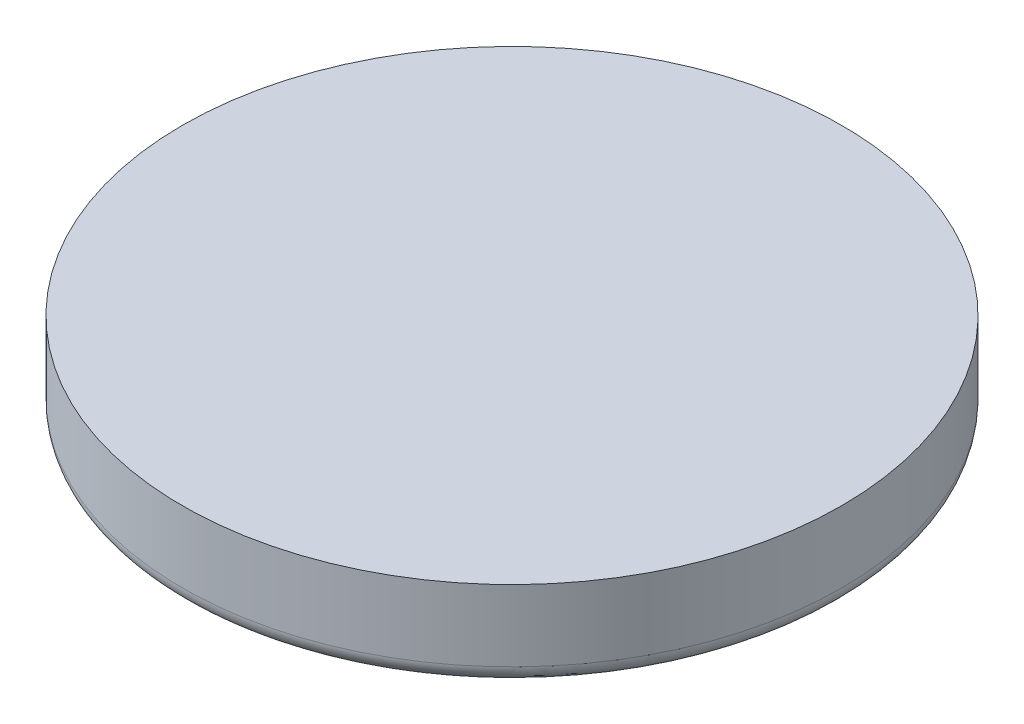
ISO-10303-21;
HEADER;
FILE_DESCRIPTION(('STEP AP214'),'2;1');
FILE_NAME('part.step','',(''),(''),'','','');
FILE_SCHEMA(('AUTOMOTIVE_DESIGN { 1 0 10303 214 1 1 1 1 }'));
ENDSEC;
DATA;
#1=APPLICATION_CONTEXT('core data for automotive mechanical design processes');
#2=APPLICATION_PROTOCOL_DEFINITION('international standard','automotive_design',2000,#1);
#3=PRODUCT_CONTEXT('',#1,'mechanical');
#4=PRODUCT('Part','Part','',(#3));
#5=PRODUCT_RELATED_PRODUCT_CATEGORY('part','',(#4));
#6=PRODUCT_DEFINITION_FORMATION('','',#4);
#7=PRODUCT_DEFINITION_CONTEXT('part definition',#1,'design');
#8=PRODUCT_DEFINITION('design','',#6,#7);
#9=PRODUCT_DEFINITION_SHAPE('','',#8);
#10=(LENGTH_UNIT() NAMED_UNIT(*) SI_UNIT(.MILLI.,.METRE.));
#11=(NAMED_UNIT(*) PLANE_ANGLE_UNIT() SI_UNIT($,.RADIAN.));
#12=(NAMED_UNIT(*) SI_UNIT($,.STERADIAN.) SOLID_ANGLE_UNIT());
#13=UNCERTAINTY_MEASURE_WITH_UNIT(LENGTH_MEASURE(1.E-05),#10,'distance_accuracy_value','');
#14=(GEOMETRIC_REPRESENTATION_CONTEXT(3) GLOBAL_UNCERTAINTY_ASSIGNED_CONTEXT((#13)) GLOBAL_UNIT_ASSIGNED_CONTEXT((#10,
#11,#12)) REPRESENTATION_CONTEXT('',''));
#15=CARTESIAN_POINT('',(0.,0.,0.));
#16=DIRECTION('',(0.,0.,1.));
#17=DIRECTION('',(1.,0.,0.));
#18=AXIS2_PLACEMENT_3D('',#15,#16,#17);
#19=CARTESIAN_POINT('',(37.,13.,0.));
#20=DIRECTION('',(0.,-1.,0.));
#21=DIRECTION('',(1.,0.,0.));
#22=AXIS2_PLACEMENT_3D('',#19,#20,#21);
#23=PLANE('',#22);
#24=CARTESIAN_POINT('',(0.,13.,0.));
#25=DIRECTION('',(0.,1.,0.));
#26=DIRECTION('',(-1.,0.,0.));
#27=AXIS2_PLACEMENT_3D('',#24,#25,#26);
#28=CIRCLE('',#27,37.);
#29=CARTESIAN_POINT('',(-37.,13.,0.));
#30=VERTEX_POINT('',#29);
#31=EDGE_CURVE('E10',#30,#30,#28,.T.);
#32=ORIENTED_EDGE('',*,*,#31,.T.);
#33=EDGE_LOOP('',(#32));
#34=FACE_BOUND('',#33,.T.);
#35=ADVANCED_FACE('F31',(#34),#23,.F.);
#36=CARTESIAN_POINT('',(0.,13.,0.));
#37=DIRECTION('',(0.,1.,0.));
#38=DIRECTION('',(-1.,0.,0.));
#39=AXIS2_PLACEMENT_3D('',#36,#37,#38);
#40=CYLINDRICAL_SURFACE('',#39,37.);
#41=ORIENTED_EDGE('',*,*,#31,.F.);
#42=EDGE_LOOP('',(#41));
#43=FACE_BOUND('',#42,.T.);
#44=CARTESIAN_POINT('',(0.,5.00000000000001,0.));
#45=DIRECTION('',(0.,1.,0.));
#46=DIRECTION('',(-1.,0.,0.));
#47=AXIS2_PLACEMENT_3D('',#44,#45,#46);
#48=CIRCLE('',#47,37.);
#49=CARTESIAN_POINT('',(-37.,5.00000000000001,0.));
#50=VERTEX_POINT('',#49);
#51=EDGE_CURVE('E37',#50,#50,#48,.T.);
#52=ORIENTED_EDGE('',*,*,#51,.T.);
#53=EDGE_LOOP('',(#52));
#54=FACE_BOUND('',#53,.T.);
#55=ADVANCED_FACE('F56',(#43,#54),#40,.T.);
#56=CARTESIAN_POINT('',(0.,5.,0.));
#57=DIRECTION('',(0.,1.,0.));
#58=DIRECTION('',(-1.,0.,0.));
#59=AXIS2_PLACEMENT_3D('',#56,#57,#58);
#60=TOROIDAL_SURFACE('',#59,35.,2.);
#61=ORIENTED_EDGE('',*,*,#51,.F.);
#62=EDGE_LOOP('',(#61));
#63=FACE_BOUND('',#62,.T.);
#64=CARTESIAN_POINT('',(0.,3.,0.));
#65=DIRECTION('',(0.,1.,0.));
#66=DIRECTION('',(-1.,0.,0.));
#67=AXIS2_PLACEMENT_3D('',#64,#65,#66);
#68=CIRCLE('',#67,35.);
#69=CARTESIAN_POINT('',(-35.,3.,0.));
#70=VERTEX_POINT('',#69);
#71=EDGE_CURVE('E41',#70,#70,#68,.T.);
#72=ORIENTED_EDGE('',*,*,#71,.T.);
#73=EDGE_LOOP('',(#72));
#74=FACE_BOUND('',#73,.T.);
#75=ADVANCED_FACE('F48',(#63,#74),#60,.T.);
#76=CARTESIAN_POINT('',(0.,3.,0.));
#77=DIRECTION('',(0.,1.,0.));
#78=DIRECTION('',(-1.,0.,0.));
#79=AXIS2_PLACEMENT_3D('',#76,#77,#78);
#80=PLANE('',#79);
#81=ORIENTED_EDGE('',*,*,#71,.F.);
#82=EDGE_LOOP('',(#81));
#83=FACE_BOUND('',#82,.T.);
#84=ADVANCED_FACE('F50',(#83),#80,.F.);
#85=CLOSED_SHELL('',(#35,#55,#75,#84));
#86=MANIFOLD_SOLID_BREP('B2',#85);
#87=ADVANCED_BREP_SHAPE_REPRESENTATION('',(#18,#86),#14);
#88=SHAPE_DEFINITION_REPRESENTATION(#9,#87);
ENDSEC;
END-ISO-10303-21;
